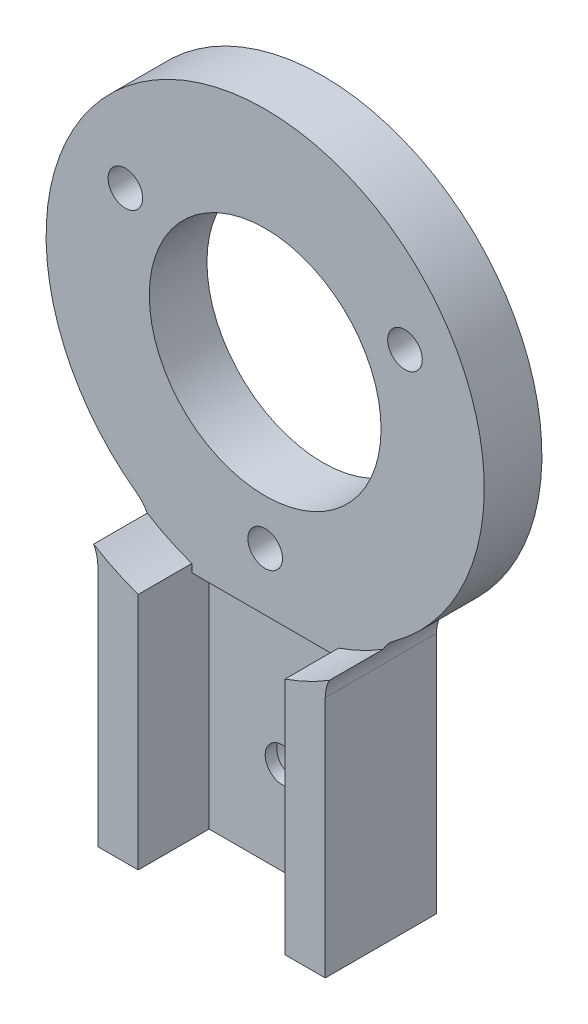
ISO-10303-21;
HEADER;
FILE_DESCRIPTION(('STEP AP214'),'2;1');
FILE_NAME('part.step','',(''),(''),'','','');
FILE_SCHEMA(('AUTOMOTIVE_DESIGN { 1 0 10303 214 1 1 1 1 }'));
ENDSEC;
DATA;
#1=APPLICATION_CONTEXT('core data for automotive mechanical design processes');
#2=APPLICATION_PROTOCOL_DEFINITION('international standard','automotive_design',2000,#1);
#3=PRODUCT_CONTEXT('',#1,'mechanical');
#4=PRODUCT('Part','Part','',(#3));
#5=PRODUCT_RELATED_PRODUCT_CATEGORY('part','',(#4));
#6=PRODUCT_DEFINITION_FORMATION('','',#4);
#7=PRODUCT_DEFINITION_CONTEXT('part definition',#1,'design');
#8=PRODUCT_DEFINITION('design','',#6,#7);
#9=PRODUCT_DEFINITION_SHAPE('','',#8);
#10=(LENGTH_UNIT() NAMED_UNIT(*) SI_UNIT(.MILLI.,.METRE.));
#11=(NAMED_UNIT(*) PLANE_ANGLE_UNIT() SI_UNIT($,.RADIAN.));
#12=(NAMED_UNIT(*) SI_UNIT($,.STERADIAN.) SOLID_ANGLE_UNIT());
#13=UNCERTAINTY_MEASURE_WITH_UNIT(LENGTH_MEASURE(1.E-05),#10,'distance_accuracy_value','');
#14=(GEOMETRIC_REPRESENTATION_CONTEXT(3) GLOBAL_UNCERTAINTY_ASSIGNED_CONTEXT((#13)) GLOBAL_UNIT_ASSIGNED_CONTEXT((#10,
#11,#12)) REPRESENTATION_CONTEXT('',''));
#15=CARTESIAN_POINT('',(0.,0.,0.));
#16=DIRECTION('',(0.,0.,1.));
#17=DIRECTION('',(1.,0.,0.));
#18=AXIS2_PLACEMENT_3D('',#15,#16,#17);
#19=CARTESIAN_POINT('',(0.,-31.,7.));
#20=DIRECTION('',(0.,0.,-1.));
#21=DIRECTION('',(-1.,0.,0.));
#22=AXIS2_PLACEMENT_3D('',#19,#20,#21);
#23=CYLINDRICAL_SURFACE('',#22,1.5);
#24=CARTESIAN_POINT('',(0.,-31.,3.5));
#25=DIRECTION('',(0.,0.,-1.));
#26=DIRECTION('',(-1.,0.,0.));
#27=AXIS2_PLACEMENT_3D('',#24,#25,#26);
#28=CIRCLE('',#27,1.5);
#29=CARTESIAN_POINT('',(-1.5,-31.,3.5));
#30=VERTEX_POINT('',#29);
#31=EDGE_CURVE('E257',#30,#30,#28,.T.);
#32=ORIENTED_EDGE('',*,*,#31,.F.);
#33=EDGE_LOOP('',(#32));
#34=FACE_BOUND('',#33,.T.);
#35=CARTESIAN_POINT('',(0.,-31.,2.5));
#36=DIRECTION('',(0.,0.,-1.));
#37=DIRECTION('',(-1.,0.,0.));
#38=AXIS2_PLACEMENT_3D('',#35,#36,#37);
#39=CIRCLE('',#38,1.5);
#40=CARTESIAN_POINT('',(-1.5,-31.,2.5));
#41=VERTEX_POINT('',#40);
#42=EDGE_CURVE('E262',#41,#41,#39,.F.);
#43=ORIENTED_EDGE('',*,*,#42,.F.);
#44=EDGE_LOOP('',(#43));
#45=FACE_BOUND('',#44,.T.);
#46=ADVANCED_FACE('F37',(#34,#45),#23,.F.);
#47=CARTESIAN_POINT('',(0.,0.,5.));
#48=DIRECTION('',(0.,0.,-1.));
#49=DIRECTION('',(-1.,0.,0.));
#50=AXIS2_PLACEMENT_3D('',#47,#48,#49);
#51=PLANE('',#50);
#52=CARTESIAN_POINT('',(0.,-14.,5.));
#53=DIRECTION('',(0.,0.,1.));
#54=DIRECTION('',(1.,0.,0.));
#55=AXIS2_PLACEMENT_3D('',#52,#53,#54);
#56=CIRCLE('',#55,1.5);
#57=CARTESIAN_POINT('',(1.5,-14.,5.));
#58=VERTEX_POINT('',#57);
#59=EDGE_CURVE('E212',#58,#58,#56,.T.);
#60=ORIENTED_EDGE('',*,*,#59,.F.);
#61=EDGE_LOOP('',(#60));
#62=FACE_BOUND('',#61,.T.);
#63=CARTESIAN_POINT('',(-12.1243556529822,6.99999999999997,5.));
#64=DIRECTION('',(0.,0.,1.));
#65=DIRECTION('',(1.,0.,0.));
#66=AXIS2_PLACEMENT_3D('',#63,#64,#65);
#67=CIRCLE('',#66,1.5);
#68=CARTESIAN_POINT('',(-10.6243556529822,6.99999999999997,5.));
#69=VERTEX_POINT('',#68);
#70=EDGE_CURVE('E209',#69,#69,#67,.T.);
#71=ORIENTED_EDGE('',*,*,#70,.F.);
#72=EDGE_LOOP('',(#71));
#73=FACE_BOUND('',#72,.T.);
#74=CARTESIAN_POINT('',(12.1243556529821,7.00000000000006,5.));
#75=DIRECTION('',(0.,0.,1.));
#76=DIRECTION('',(1.,0.,0.));
#77=AXIS2_PLACEMENT_3D('',#74,#75,#76);
#78=CIRCLE('',#77,1.5);
#79=CARTESIAN_POINT('',(13.6243556529821,7.00000000000006,5.));
#80=VERTEX_POINT('',#79);
#81=EDGE_CURVE('E206',#80,#80,#78,.T.);
#82=ORIENTED_EDGE('',*,*,#81,.F.);
#83=EDGE_LOOP('',(#82));
#84=FACE_BOUND('',#83,.T.);
#85=CARTESIAN_POINT('',(0.,0.,5.));
#86=DIRECTION('',(0.,0.,-1.));
#87=DIRECTION('',(-1.,0.,0.));
#88=AXIS2_PLACEMENT_3D('',#85,#86,#87);
#89=CIRCLE('',#88,10.05);
#90=CARTESIAN_POINT('',(-10.05,0.,5.));
#91=VERTEX_POINT('',#90);
#92=EDGE_CURVE('E172',#91,#91,#89,.T.);
#93=ORIENTED_EDGE('',*,*,#92,.T.);
#94=EDGE_LOOP('',(#93));
#95=FACE_BOUND('',#94,.T.);
#96=CARTESIAN_POINT('',(0.,0.,5.));
#97=DIRECTION('',(0.,0.,1.));
#98=DIRECTION('',(-1.,0.,0.));
#99=AXIS2_PLACEMENT_3D('',#96,#97,#98);
#100=CIRCLE('',#99,19.);
#101=CARTESIAN_POINT('',(11.1686583990981,-15.3707862376736,5.));
#102=VERTEX_POINT('',#101);
#103=CARTESIAN_POINT('',(-11.1686583990981,-15.3707862376736,5.));
#104=VERTEX_POINT('',#103);
#105=EDGE_CURVE('E239',#102,#104,#100,.T.);
#106=ORIENTED_EDGE('',*,*,#105,.T.);
#107=CARTESIAN_POINT('',(-13.035,-17.9393255168638,5.));
#108=DIRECTION('',(0.,0.,-1.));
#109=DIRECTION('',(-1.,0.,0.));
#110=AXIS2_PLACEMENT_3D('',#107,#108,#109);
#111=CIRCLE('',#110,3.175);
#112=CARTESIAN_POINT('',(-10.2282118783563,-16.4552212616984,5.));
#113=VERTEX_POINT('',#112);
#114=EDGE_CURVE('E291',#104,#113,#111,.T.);
#115=ORIENTED_EDGE('',*,*,#114,.T.);
#116=CARTESIAN_POINT('',(0.,0.,5.));
#117=DIRECTION('',(0.,0.,1.));
#118=DIRECTION('',(-1.,0.,0.));
#119=AXIS2_PLACEMENT_3D('',#116,#117,#118);
#120=CIRCLE('',#119,19.375);
#121=CARTESIAN_POINT('',(-6.36,-18.3013940725837,5.));
#122=VERTEX_POINT('',#121);
#123=EDGE_CURVE('E58',#113,#122,#120,.T.);
#124=ORIENTED_EDGE('',*,*,#123,.T.);
#125=DIRECTION('',(0.,-1.,0.));
#126=VECTOR('',#125,1.);
#127=CARTESIAN_POINT('',(-6.36,-19.,5.));
#128=LINE('',#127,#126);
#129=CARTESIAN_POINT('',(-6.36,-19.,5.));
#130=VERTEX_POINT('',#129);
#131=EDGE_CURVE('E154',#122,#130,#128,.T.);
#132=ORIENTED_EDGE('',*,*,#131,.T.);
#133=DIRECTION('',(-1.,0.,0.));
#134=VECTOR('',#133,1.);
#135=CARTESIAN_POINT('',(-6.36,-19.,5.));
#136=LINE('',#135,#134);
#137=CARTESIAN_POINT('',(6.36,-19.,5.));
#138=VERTEX_POINT('',#137);
#139=EDGE_CURVE('E225',#138,#130,#136,.T.);
#140=ORIENTED_EDGE('',*,*,#139,.F.);
#141=DIRECTION('',(0.,-1.,0.));
#142=VECTOR('',#141,1.);
#143=CARTESIAN_POINT('',(6.36,-19.,5.));
#144=LINE('',#143,#142);
#145=CARTESIAN_POINT('',(6.36,-18.3013940725837,5.));
#146=VERTEX_POINT('',#145);
#147=EDGE_CURVE('E165',#146,#138,#144,.T.);
#148=ORIENTED_EDGE('',*,*,#147,.F.);
#149=CARTESIAN_POINT('',(0.,0.,5.));
#150=DIRECTION('',(0.,0.,-1.));
#151=DIRECTION('',(1.,0.,0.));
#152=AXIS2_PLACEMENT_3D('',#149,#150,#151);
#153=CIRCLE('',#152,19.375);
#154=CARTESIAN_POINT('',(10.2282118783563,-16.4552212616984,5.));
#155=VERTEX_POINT('',#154);
#156=EDGE_CURVE('E150',#155,#146,#153,.T.);
#157=ORIENTED_EDGE('',*,*,#156,.F.);
#158=CARTESIAN_POINT('',(13.035,-17.9393255168638,5.));
#159=DIRECTION('',(0.,0.,-1.));
#160=DIRECTION('',(-1.,0.,0.));
#161=AXIS2_PLACEMENT_3D('',#158,#159,#160);
#162=CIRCLE('',#161,3.175);
#163=EDGE_CURVE('E287',#155,#102,#162,.T.);
#164=ORIENTED_EDGE('',*,*,#163,.T.);
#165=EDGE_LOOP('',(#106,#115,#124,#132,#140,#148,#157,#164));
#166=FACE_BOUND('',#165,.T.);
#167=ADVANCED_FACE('F294',(#62,#73,#84,#95,#166),#51,.F.);
#168=CARTESIAN_POINT('',(-12.1243556529822,6.99999999999997,0.));
#169=DIRECTION('',(0.,0.,1.));
#170=DIRECTION('',(1.,0.,0.));
#171=AXIS2_PLACEMENT_3D('',#168,#169,#170);
#172=CYLINDRICAL_SURFACE('',#171,1.5);
#173=ORIENTED_EDGE('',*,*,#70,.T.);
#174=EDGE_LOOP('',(#173));
#175=FACE_BOUND('',#174,.T.);
#176=CARTESIAN_POINT('',(-12.1243556529822,6.99999999999997,2.5));
#177=DIRECTION('',(0.,0.,-1.));
#178=DIRECTION('',(-1.,0.,0.));
#179=AXIS2_PLACEMENT_3D('',#176,#177,#178);
#180=CIRCLE('',#179,1.5);
#181=CARTESIAN_POINT('',(-13.6243556529822,6.99999999999997,2.5));
#182=VERTEX_POINT('',#181);
#183=EDGE_CURVE('E179',#182,#182,#180,.F.);
#184=ORIENTED_EDGE('',*,*,#183,.F.);
#185=EDGE_LOOP('',(#184));
#186=FACE_BOUND('',#185,.T.);
#187=ADVANCED_FACE('F317',(#175,#186),#172,.F.);
#188=CARTESIAN_POINT('',(12.1243556529821,7.00000000000006,0.));
#189=DIRECTION('',(0.,0.,1.));
#190=DIRECTION('',(1.,0.,0.));
#191=AXIS2_PLACEMENT_3D('',#188,#189,#190);
#192=CYLINDRICAL_SURFACE('',#191,1.5);
#193=ORIENTED_EDGE('',*,*,#81,.T.);
#194=EDGE_LOOP('',(#193));
#195=FACE_BOUND('',#194,.T.);
#196=CARTESIAN_POINT('',(12.1243556529821,7.00000000000006,2.5));
#197=DIRECTION('',(0.,0.,-1.));
#198=DIRECTION('',(-1.,0.,0.));
#199=AXIS2_PLACEMENT_3D('',#196,#197,#198);
#200=CIRCLE('',#199,1.5);
#201=CARTESIAN_POINT('',(10.6243556529821,7.00000000000006,2.5));
#202=VERTEX_POINT('',#201);
#203=EDGE_CURVE('E185',#202,#202,#200,.F.);
#204=ORIENTED_EDGE('',*,*,#203,.F.);
#205=EDGE_LOOP('',(#204));
#206=FACE_BOUND('',#205,.T.);
#207=ADVANCED_FACE('F314',(#195,#206),#192,.F.);
#208=CARTESIAN_POINT('',(0.,-14.,0.));
#209=DIRECTION('',(0.,0.,1.));
#210=DIRECTION('',(1.,0.,0.));
#211=AXIS2_PLACEMENT_3D('',#208,#209,#210);
#212=CYLINDRICAL_SURFACE('',#211,1.5);
#213=ORIENTED_EDGE('',*,*,#59,.T.);
#214=EDGE_LOOP('',(#213));
#215=FACE_BOUND('',#214,.T.);
#216=CARTESIAN_POINT('',(0.,-14.,2.5));
#217=DIRECTION('',(0.,0.,-1.));
#218=DIRECTION('',(-1.,0.,0.));
#219=AXIS2_PLACEMENT_3D('',#216,#217,#218);
#220=CIRCLE('',#219,1.5);
#221=CARTESIAN_POINT('',(-1.5,-14.,2.5));
#222=VERTEX_POINT('',#221);
#223=EDGE_CURVE('E192',#222,#222,#220,.F.);
#224=ORIENTED_EDGE('',*,*,#223,.F.);
#225=EDGE_LOOP('',(#224));
#226=FACE_BOUND('',#225,.T.);
#227=ADVANCED_FACE('F316',(#215,#226),#212,.F.);
#228=CARTESIAN_POINT('',(0.,0.,0.));
#229=DIRECTION('',(0.,0.,-1.));
#230=DIRECTION('',(-1.,0.,0.));
#231=AXIS2_PLACEMENT_3D('',#228,#229,#230);
#232=PLANE('',#231);
#233=CARTESIAN_POINT('',(0.,-31.,0.));
#234=DIRECTION('',(0.,0.,-1.));
#235=DIRECTION('',(-1.,0.,0.));
#236=AXIS2_PLACEMENT_3D('',#233,#234,#235);
#237=CIRCLE('',#236,3.);
#238=CARTESIAN_POINT('',(-3.,-31.,0.));
#239=VERTEX_POINT('',#238);
#240=EDGE_CURVE('E454',#239,#239,#237,.T.);
#241=ORIENTED_EDGE('',*,*,#240,.F.);
#242=EDGE_LOOP('',(#241));
#243=FACE_BOUND('',#242,.T.);
#244=CARTESIAN_POINT('',(0.,0.,0.));
#245=DIRECTION('',(0.,0.,-1.));
#246=DIRECTION('',(-1.,0.,0.));
#247=AXIS2_PLACEMENT_3D('',#244,#245,#246);
#248=CIRCLE('',#247,10.05);
#249=CARTESIAN_POINT('',(-10.05,0.,0.));
#250=VERTEX_POINT('',#249);
#251=EDGE_CURVE('E161',#250,#250,#248,.T.);
#252=ORIENTED_EDGE('',*,*,#251,.F.);
#253=EDGE_LOOP('',(#252));
#254=FACE_BOUND('',#253,.T.);
#255=CARTESIAN_POINT('',(-12.1243556529822,6.99999999999997,0.));
#256=DIRECTION('',(0.,0.,-1.));
#257=DIRECTION('',(-1.,0.,0.));
#258=AXIS2_PLACEMENT_3D('',#255,#256,#257);
#259=CIRCLE('',#258,3.);
#260=CARTESIAN_POINT('',(-15.1243556529822,6.99999999999997,0.));
#261=VERTEX_POINT('',#260);
#262=EDGE_CURVE('E175',#261,#261,#259,.T.);
#263=ORIENTED_EDGE('',*,*,#262,.F.);
#264=EDGE_LOOP('',(#263));
#265=FACE_BOUND('',#264,.T.);
#266=CARTESIAN_POINT('',(12.1243556529821,7.00000000000006,0.));
#267=DIRECTION('',(0.,0.,-1.));
#268=DIRECTION('',(-1.,0.,0.));
#269=AXIS2_PLACEMENT_3D('',#266,#267,#268);
#270=CIRCLE('',#269,3.);
#271=CARTESIAN_POINT('',(9.12435565298211,7.00000000000006,0.));
#272=VERTEX_POINT('',#271);
#273=EDGE_CURVE('E186',#272,#272,#270,.T.);
#274=ORIENTED_EDGE('',*,*,#273,.F.);
#275=EDGE_LOOP('',(#274));
#276=FACE_BOUND('',#275,.T.);
#277=CARTESIAN_POINT('',(0.,-14.,0.));
#278=DIRECTION('',(0.,0.,-1.));
#279=DIRECTION('',(-1.,0.,0.));
#280=AXIS2_PLACEMENT_3D('',#277,#278,#279);
#281=CIRCLE('',#280,3.);
#282=CARTESIAN_POINT('',(-3.,-14.,0.));
#283=VERTEX_POINT('',#282);
#284=EDGE_CURVE('E193',#283,#283,#281,.T.);
#285=ORIENTED_EDGE('',*,*,#284,.F.);
#286=EDGE_LOOP('',(#285));
#287=FACE_BOUND('',#286,.T.);
#288=DIRECTION('',(0.,-1.,0.));
#289=VECTOR('',#288,1.);
#290=CARTESIAN_POINT('',(-9.86,-39.,0.));
#291=LINE('',#290,#289);
#292=CARTESIAN_POINT('',(-9.86,-17.9393255168638,0.));
#293=VERTEX_POINT('',#292);
#294=CARTESIAN_POINT('',(-9.86,-39.,0.));
#295=VERTEX_POINT('',#294);
#296=EDGE_CURVE('E236',#293,#295,#291,.T.);
#297=ORIENTED_EDGE('',*,*,#296,.F.);
#298=CARTESIAN_POINT('',(-13.035,-17.9393255168638,0.));
#299=DIRECTION('',(0.,0.,-1.));
#300=DIRECTION('',(-1.,0.,0.));
#301=AXIS2_PLACEMENT_3D('',#298,#299,#300);
#302=CIRCLE('',#301,3.175);
#303=CARTESIAN_POINT('',(-11.1686583990981,-15.3707862376736,0.));
#304=VERTEX_POINT('',#303);
#305=EDGE_CURVE('E289',#293,#304,#302,.F.);
#306=ORIENTED_EDGE('',*,*,#305,.T.);
#307=CARTESIAN_POINT('',(0.,0.,0.));
#308=DIRECTION('',(0.,0.,1.));
#309=DIRECTION('',(-1.,0.,0.));
#310=AXIS2_PLACEMENT_3D('',#307,#308,#309);
#311=CIRCLE('',#310,19.);
#312=CARTESIAN_POINT('',(11.1686583990981,-15.3707862376736,0.));
#313=VERTEX_POINT('',#312);
#314=EDGE_CURVE('E243',#313,#304,#311,.T.);
#315=ORIENTED_EDGE('',*,*,#314,.F.);
#316=CARTESIAN_POINT('',(13.035,-17.9393255168638,0.));
#317=DIRECTION('',(0.,0.,-1.));
#318=DIRECTION('',(-1.,0.,0.));
#319=AXIS2_PLACEMENT_3D('',#316,#317,#318);
#320=CIRCLE('',#319,3.175);
#321=CARTESIAN_POINT('',(9.86,-17.9393255168638,0.));
#322=VERTEX_POINT('',#321);
#323=EDGE_CURVE('E279',#313,#322,#320,.F.);
#324=ORIENTED_EDGE('',*,*,#323,.T.);
#325=DIRECTION('',(0.,1.,0.));
#326=VECTOR('',#325,1.);
#327=CARTESIAN_POINT('',(9.86,-39.,0.));
#328=LINE('',#327,#326);
#329=CARTESIAN_POINT('',(9.86,-39.,0.));
#330=VERTEX_POINT('',#329);
#331=EDGE_CURVE('E247',#330,#322,#328,.T.);
#332=ORIENTED_EDGE('',*,*,#331,.F.);
#333=DIRECTION('',(1.,0.,0.));
#334=VECTOR('',#333,1.);
#335=CARTESIAN_POINT('',(9.86,-39.,0.));
#336=LINE('',#335,#334);
#337=EDGE_CURVE('E244',#295,#330,#336,.T.);
#338=ORIENTED_EDGE('',*,*,#337,.F.);
#339=EDGE_LOOP('',(#297,#306,#315,#324,#332,#338));
#340=FACE_BOUND('',#339,.T.);
#341=ADVANCED_FACE('F324',(#243,#254,#265,#276,#287,#340),#232,.T.);
#342=CARTESIAN_POINT('',(-9.86,-39.,5.));
#343=DIRECTION('',(1.,0.,0.));
#344=DIRECTION('',(0.,0.,-1.));
#345=AXIS2_PLACEMENT_3D('',#342,#343,#344);
#346=PLANE('',#345);
#347=DIRECTION('',(0.,1.,0.));
#348=VECTOR('',#347,1.);
#349=CARTESIAN_POINT('',(-9.86,-39.,9.65));
#350=LINE('',#349,#348);
#351=CARTESIAN_POINT('',(-9.86,-39.,9.65));
#352=VERTEX_POINT('',#351);
#353=CARTESIAN_POINT('',(-9.86,-17.9393255168638,9.65));
#354=VERTEX_POINT('',#353);
#355=EDGE_CURVE('E203',#352,#354,#350,.T.);
#356=ORIENTED_EDGE('',*,*,#355,.T.);
#357=DIRECTION('',(0.,0.,1.));
#358=VECTOR('',#357,1.);
#359=CARTESIAN_POINT('',(-9.86,-17.9393255168638,0.));
#360=LINE('',#359,#358);
#361=EDGE_CURVE('E276',#354,#293,#360,.F.);
#362=ORIENTED_EDGE('',*,*,#361,.T.);
#363=ORIENTED_EDGE('',*,*,#296,.T.);
#364=DIRECTION('',(0.,0.,-1.));
#365=VECTOR('',#364,1.);
#366=CARTESIAN_POINT('',(-9.86,-39.,5.));
#367=LINE('',#366,#365);
#368=EDGE_CURVE('E271',#352,#295,#367,.T.);
#369=ORIENTED_EDGE('',*,*,#368,.F.);
#370=EDGE_LOOP('',(#356,#362,#363,#369));
#371=FACE_BOUND('',#370,.T.);
#372=ADVANCED_FACE('F300',(#371),#346,.F.);
#373=CARTESIAN_POINT('',(9.86,-39.,5.));
#374=DIRECTION('',(0.,1.,0.));
#375=DIRECTION('',(0.,0.,1.));
#376=AXIS2_PLACEMENT_3D('',#373,#374,#375);
#377=PLANE('',#376);
#378=DIRECTION('',(1.,0.,0.));
#379=VECTOR('',#378,1.);
#380=CARTESIAN_POINT('',(6.36,-39.,3.5));
#381=LINE('',#380,#379);
#382=CARTESIAN_POINT('',(-6.36,-39.,3.5));
#383=VERTEX_POINT('',#382);
#384=CARTESIAN_POINT('',(6.36,-39.,3.5));
#385=VERTEX_POINT('',#384);
#386=EDGE_CURVE('E230',#383,#385,#381,.T.);
#387=ORIENTED_EDGE('',*,*,#386,.F.);
#388=DIRECTION('',(0.,0.,-1.));
#389=VECTOR('',#388,1.);
#390=CARTESIAN_POINT('',(-6.36,-39.,3.5));
#391=LINE('',#390,#389);
#392=CARTESIAN_POINT('',(-6.36,-39.,9.65));
#393=VERTEX_POINT('',#392);
#394=EDGE_CURVE('E215',#393,#383,#391,.T.);
#395=ORIENTED_EDGE('',*,*,#394,.F.);
#396=DIRECTION('',(-1.,0.,0.));
#397=VECTOR('',#396,1.);
#398=CARTESIAN_POINT('',(-9.86,-39.,9.65));
#399=LINE('',#398,#397);
#400=EDGE_CURVE('E140',#393,#352,#399,.T.);
#401=ORIENTED_EDGE('',*,*,#400,.T.);
#402=ORIENTED_EDGE('',*,*,#368,.T.);
#403=ORIENTED_EDGE('',*,*,#337,.T.);
#404=DIRECTION('',(0.,0.,-1.));
#405=VECTOR('',#404,1.);
#406=CARTESIAN_POINT('',(9.86,-39.,5.));
#407=LINE('',#406,#405);
#408=CARTESIAN_POINT('',(9.86,-39.,9.65));
#409=VERTEX_POINT('',#408);
#410=EDGE_CURVE('E242',#409,#330,#407,.T.);
#411=ORIENTED_EDGE('',*,*,#410,.F.);
#412=DIRECTION('',(-1.,0.,0.));
#413=VECTOR('',#412,1.);
#414=CARTESIAN_POINT('',(6.36,-39.,9.65));
#415=LINE('',#414,#413);
#416=CARTESIAN_POINT('',(6.36,-39.,9.65));
#417=VERTEX_POINT('',#416);
#418=EDGE_CURVE('E198',#409,#417,#415,.T.);
#419=ORIENTED_EDGE('',*,*,#418,.T.);
#420=DIRECTION('',(0.,0.,1.));
#421=VECTOR('',#420,1.);
#422=CARTESIAN_POINT('',(6.36,-39.,5.));
#423=LINE('',#422,#421);
#424=EDGE_CURVE('E220',#385,#417,#423,.T.);
#425=ORIENTED_EDGE('',*,*,#424,.F.);
#426=EDGE_LOOP('',(#387,#395,#401,#402,#403,#411,#419,#425));
#427=FACE_BOUND('',#426,.T.);
#428=ADVANCED_FACE('F411',(#427),#377,.F.);
#429=CARTESIAN_POINT('',(9.86,-39.,5.));
#430=DIRECTION('',(-1.,0.,0.));
#431=DIRECTION('',(0.,0.,1.));
#432=AXIS2_PLACEMENT_3D('',#429,#430,#431);
#433=PLANE('',#432);
#434=ORIENTED_EDGE('',*,*,#331,.T.);
#435=DIRECTION('',(0.,0.,1.));
#436=VECTOR('',#435,1.);
#437=CARTESIAN_POINT('',(9.86,-17.9393255168638,5.));
#438=LINE('',#437,#436);
#439=CARTESIAN_POINT('',(9.86,-17.9393255168638,9.65));
#440=VERTEX_POINT('',#439);
#441=EDGE_CURVE('E274',#322,#440,#438,.T.);
#442=ORIENTED_EDGE('',*,*,#441,.T.);
#443=DIRECTION('',(0.,-1.,0.));
#444=VECTOR('',#443,1.);
#445=CARTESIAN_POINT('',(9.86,-39.,9.65));
#446=LINE('',#445,#444);
#447=EDGE_CURVE('E196',#440,#409,#446,.T.);
#448=ORIENTED_EDGE('',*,*,#447,.T.);
#449=ORIENTED_EDGE('',*,*,#410,.T.);
#450=EDGE_LOOP('',(#434,#442,#448,#449));
#451=FACE_BOUND('',#450,.T.);
#452=ADVANCED_FACE('F407',(#451),#433,.F.);
#453=CARTESIAN_POINT('',(0.,0.,5.));
#454=DIRECTION('',(0.,0.,-1.));
#455=DIRECTION('',(-1.,0.,0.));
#456=AXIS2_PLACEMENT_3D('',#453,#454,#455);
#457=CYLINDRICAL_SURFACE('',#456,19.);
#458=ORIENTED_EDGE('',*,*,#105,.F.);
#459=DIRECTION('',(0.,0.,-1.));
#460=VECTOR('',#459,1.);
#461=CARTESIAN_POINT('',(11.1686583990981,-15.3707862376736,5.));
#462=LINE('',#461,#460);
#463=EDGE_CURVE('E270',#102,#313,#462,.T.);
#464=ORIENTED_EDGE('',*,*,#463,.T.);
#465=ORIENTED_EDGE('',*,*,#314,.T.);
#466=DIRECTION('',(0.,0.,-1.));
#467=VECTOR('',#466,1.);
#468=CARTESIAN_POINT('',(-11.1686583990981,-15.3707862376736,5.));
#469=LINE('',#468,#467);
#470=EDGE_CURVE('E268',#304,#104,#469,.F.);
#471=ORIENTED_EDGE('',*,*,#470,.T.);
#472=EDGE_LOOP('',(#458,#464,#465,#471));
#473=FACE_BOUND('',#472,.T.);
#474=ADVANCED_FACE('F400',(#473),#457,.T.);
#475=CARTESIAN_POINT('',(-6.36,-19.,3.5));
#476=DIRECTION('',(-1.,0.,0.));
#477=DIRECTION('',(0.,0.,1.));
#478=AXIS2_PLACEMENT_3D('',#475,#476,#477);
#479=PLANE('',#478);
#480=ORIENTED_EDGE('',*,*,#394,.T.);
#481=DIRECTION('',(0.,-1.,0.));
#482=VECTOR('',#481,1.);
#483=CARTESIAN_POINT('',(-6.36,-19.,3.5));
#484=LINE('',#483,#482);
#485=CARTESIAN_POINT('',(-6.36,-19.,3.5));
#486=VERTEX_POINT('',#485);
#487=EDGE_CURVE('E228',#486,#383,#484,.T.);
#488=ORIENTED_EDGE('',*,*,#487,.F.);
#489=DIRECTION('',(0.,0.,-1.));
#490=VECTOR('',#489,1.);
#491=CARTESIAN_POINT('',(-6.36,-19.,3.5));
#492=LINE('',#491,#490);
#493=EDGE_CURVE('E216',#130,#486,#492,.T.);
#494=ORIENTED_EDGE('',*,*,#493,.F.);
#495=ORIENTED_EDGE('',*,*,#131,.F.);
#496=DIRECTION('',(0.,0.,-1.));
#497=VECTOR('',#496,1.);
#498=CARTESIAN_POINT('',(-6.36,-18.3013940725837,13.8499462359926));
#499=LINE('',#498,#497);
#500=CARTESIAN_POINT('',(-6.36,-18.3013940725837,9.65));
#501=VERTEX_POINT('',#500);
#502=EDGE_CURVE('E146',#501,#122,#499,.T.);
#503=ORIENTED_EDGE('',*,*,#502,.F.);
#504=DIRECTION('',(0.,-1.,0.));
#505=VECTOR('',#504,1.);
#506=CARTESIAN_POINT('',(-6.36,-39.,9.65));
#507=LINE('',#506,#505);
#508=EDGE_CURVE('E136',#501,#393,#507,.T.);
#509=ORIENTED_EDGE('',*,*,#508,.T.);
#510=EDGE_LOOP('',(#480,#488,#494,#495,#503,#509));
#511=FACE_BOUND('',#510,.T.);
#512=ADVANCED_FACE('F152',(#511),#479,.F.);
#513=CARTESIAN_POINT('',(6.36,-19.,5.));
#514=DIRECTION('',(1.,0.,0.));
#515=DIRECTION('',(0.,0.,-1.));
#516=AXIS2_PLACEMENT_3D('',#513,#514,#515);
#517=PLANE('',#516);
#518=ORIENTED_EDGE('',*,*,#424,.T.);
#519=DIRECTION('',(0.,1.,0.));
#520=VECTOR('',#519,1.);
#521=CARTESIAN_POINT('',(6.36,-39.,9.65));
#522=LINE('',#521,#520);
#523=CARTESIAN_POINT('',(6.36,-18.3013940725837,9.65));
#524=VERTEX_POINT('',#523);
#525=EDGE_CURVE('E143',#417,#524,#522,.T.);
#526=ORIENTED_EDGE('',*,*,#525,.T.);
#527=DIRECTION('',(0.,0.,-1.));
#528=VECTOR('',#527,1.);
#529=CARTESIAN_POINT('',(6.36,-18.3013940725837,13.8499462359926));
#530=LINE('',#529,#528);
#531=EDGE_CURVE('E162',#524,#146,#530,.T.);
#532=ORIENTED_EDGE('',*,*,#531,.T.);
#533=ORIENTED_EDGE('',*,*,#147,.T.);
#534=DIRECTION('',(0.,0.,1.));
#535=VECTOR('',#534,1.);
#536=CARTESIAN_POINT('',(6.36,-19.,5.));
#537=LINE('',#536,#535);
#538=CARTESIAN_POINT('',(6.36,-19.,3.5));
#539=VERTEX_POINT('',#538);
#540=EDGE_CURVE('E223',#539,#138,#537,.T.);
#541=ORIENTED_EDGE('',*,*,#540,.F.);
#542=DIRECTION('',(0.,-1.,0.));
#543=VECTOR('',#542,1.);
#544=CARTESIAN_POINT('',(6.36,-19.,3.5));
#545=LINE('',#544,#543);
#546=EDGE_CURVE('E234',#539,#385,#545,.T.);
#547=ORIENTED_EDGE('',*,*,#546,.T.);
#548=EDGE_LOOP('',(#518,#526,#532,#533,#541,#547));
#549=FACE_BOUND('',#548,.T.);
#550=ADVANCED_FACE('F392',(#549),#517,.F.);
#551=CARTESIAN_POINT('',(6.36,-19.,3.5));
#552=DIRECTION('',(0.,0.,-1.));
#553=DIRECTION('',(-1.,0.,0.));
#554=AXIS2_PLACEMENT_3D('',#551,#552,#553);
#555=PLANE('',#554);
#556=ORIENTED_EDGE('',*,*,#31,.T.);
#557=EDGE_LOOP('',(#556));
#558=FACE_BOUND('',#557,.T.);
#559=ORIENTED_EDGE('',*,*,#386,.T.);
#560=ORIENTED_EDGE('',*,*,#546,.F.);
#561=DIRECTION('',(1.,0.,0.));
#562=VECTOR('',#561,1.);
#563=CARTESIAN_POINT('',(6.36,-19.,3.5));
#564=LINE('',#563,#562);
#565=EDGE_CURVE('E219',#486,#539,#564,.T.);
#566=ORIENTED_EDGE('',*,*,#565,.F.);
#567=ORIENTED_EDGE('',*,*,#487,.T.);
#568=EDGE_LOOP('',(#559,#560,#566,#567));
#569=FACE_BOUND('',#568,.T.);
#570=ADVANCED_FACE('F386',(#558,#569),#555,.F.);
#571=CARTESIAN_POINT('',(0.,-19.,0.));
#572=DIRECTION('',(0.,1.,0.));
#573=DIRECTION('',(0.,0.,1.));
#574=AXIS2_PLACEMENT_3D('',#571,#572,#573);
#575=PLANE('',#574);
#576=ORIENTED_EDGE('',*,*,#493,.T.);
#577=ORIENTED_EDGE('',*,*,#565,.T.);
#578=ORIENTED_EDGE('',*,*,#540,.T.);
#579=ORIENTED_EDGE('',*,*,#139,.T.);
#580=EDGE_LOOP('',(#576,#577,#578,#579));
#581=FACE_BOUND('',#580,.T.);
#582=ADVANCED_FACE('F382',(#581),#575,.F.);
#583=CARTESIAN_POINT('',(0.,0.,9.65));
#584=DIRECTION('',(0.,0.,-1.));
#585=DIRECTION('',(-1.,0.,0.));
#586=AXIS2_PLACEMENT_3D('',#583,#584,#585);
#587=PLANE('',#586);
#588=ORIENTED_EDGE('',*,*,#400,.F.);
#589=ORIENTED_EDGE('',*,*,#508,.F.);
#590=CARTESIAN_POINT('',(0.,0.,9.65));
#591=DIRECTION('',(0.,0.,-1.));
#592=DIRECTION('',(-1.,0.,0.));
#593=AXIS2_PLACEMENT_3D('',#590,#591,#592);
#594=CIRCLE('',#593,19.375);
#595=CARTESIAN_POINT('',(-10.2282118783563,-16.4552212616984,9.65));
#596=VERTEX_POINT('',#595);
#597=EDGE_CURVE('E51',#501,#596,#594,.T.);
#598=ORIENTED_EDGE('',*,*,#597,.T.);
#599=CARTESIAN_POINT('',(-13.035,-17.9393255168638,9.65));
#600=DIRECTION('',(0.,0.,-1.));
#601=DIRECTION('',(-1.,0.,0.));
#602=AXIS2_PLACEMENT_3D('',#599,#600,#601);
#603=CIRCLE('',#602,3.175);
#604=EDGE_CURVE('E13',#596,#354,#603,.T.);
#605=ORIENTED_EDGE('',*,*,#604,.T.);
#606=ORIENTED_EDGE('',*,*,#355,.F.);
#607=EDGE_LOOP('',(#588,#589,#598,#605,#606));
#608=FACE_BOUND('',#607,.T.);
#609=ADVANCED_FACE('F137',(#608),#587,.F.);
#610=CARTESIAN_POINT('',(0.,0.,9.65));
#611=DIRECTION('',(0.,0.,-1.));
#612=DIRECTION('',(-1.,0.,0.));
#613=AXIS2_PLACEMENT_3D('',#610,#611,#612);
#614=PLANE('',#613);
#615=ORIENTED_EDGE('',*,*,#418,.F.);
#616=ORIENTED_EDGE('',*,*,#447,.F.);
#617=CARTESIAN_POINT('',(13.035,-17.9393255168638,9.65));
#618=DIRECTION('',(0.,0.,-1.));
#619=DIRECTION('',(-1.,0.,0.));
#620=AXIS2_PLACEMENT_3D('',#617,#618,#619);
#621=CIRCLE('',#620,3.175);
#622=CARTESIAN_POINT('',(10.2282118783563,-16.4552212616984,9.65));
#623=VERTEX_POINT('',#622);
#624=EDGE_CURVE('E281',#440,#623,#621,.T.);
#625=ORIENTED_EDGE('',*,*,#624,.T.);
#626=CARTESIAN_POINT('',(0.,0.,9.65));
#627=DIRECTION('',(0.,0.,-1.));
#628=DIRECTION('',(-1.,0.,0.));
#629=AXIS2_PLACEMENT_3D('',#626,#627,#628);
#630=CIRCLE('',#629,19.375);
#631=EDGE_CURVE('E159',#524,#623,#630,.F.);
#632=ORIENTED_EDGE('',*,*,#631,.F.);
#633=ORIENTED_EDGE('',*,*,#525,.F.);
#634=EDGE_LOOP('',(#615,#616,#625,#632,#633));
#635=FACE_BOUND('',#634,.T.);
#636=ADVANCED_FACE('F374',(#635),#614,.F.);
#637=CARTESIAN_POINT('',(0.,-14.,2.5));
#638=DIRECTION('',(0.,0.,-1.));
#639=DIRECTION('',(-1.,0.,0.));
#640=AXIS2_PLACEMENT_3D('',#637,#638,#639);
#641=PLANE('',#640);
#642=CARTESIAN_POINT('',(0.,-14.,2.5));
#643=DIRECTION('',(0.,0.,-1.));
#644=DIRECTION('',(-1.,0.,0.));
#645=AXIS2_PLACEMENT_3D('',#642,#643,#644);
#646=CIRCLE('',#645,3.);
#647=CARTESIAN_POINT('',(-3.,-14.,2.5));
#648=VERTEX_POINT('',#647);
#649=EDGE_CURVE('E189',#648,#648,#646,.T.);
#650=ORIENTED_EDGE('',*,*,#649,.T.);
#651=EDGE_LOOP('',(#650));
#652=FACE_BOUND('',#651,.T.);
#653=ORIENTED_EDGE('',*,*,#223,.T.);
#654=EDGE_LOOP('',(#653));
#655=FACE_BOUND('',#654,.T.);
#656=ADVANCED_FACE('F371',(#652,#655),#641,.T.);
#657=CARTESIAN_POINT('',(0.,-14.,2.5));
#658=DIRECTION('',(0.,0.,-1.));
#659=DIRECTION('',(-1.,0.,0.));
#660=AXIS2_PLACEMENT_3D('',#657,#658,#659);
#661=CYLINDRICAL_SURFACE('',#660,3.);
#662=ORIENTED_EDGE('',*,*,#649,.F.);
#663=EDGE_LOOP('',(#662));
#664=FACE_BOUND('',#663,.T.);
#665=ORIENTED_EDGE('',*,*,#284,.T.);
#666=EDGE_LOOP('',(#665));
#667=FACE_BOUND('',#666,.T.);
#668=ADVANCED_FACE('F366',(#664,#667),#661,.F.);
#669=CARTESIAN_POINT('',(12.1243556529821,7.00000000000006,2.5));
#670=DIRECTION('',(0.,0.,-1.));
#671=DIRECTION('',(-1.,0.,0.));
#672=AXIS2_PLACEMENT_3D('',#669,#670,#671);
#673=PLANE('',#672);
#674=CARTESIAN_POINT('',(12.1243556529821,7.00000000000006,2.5));
#675=DIRECTION('',(0.,0.,-1.));
#676=DIRECTION('',(-1.,0.,0.));
#677=AXIS2_PLACEMENT_3D('',#674,#675,#676);
#678=CIRCLE('',#677,3.);
#679=CARTESIAN_POINT('',(9.12435565298211,7.00000000000006,2.5));
#680=VERTEX_POINT('',#679);
#681=EDGE_CURVE('E182',#680,#680,#678,.T.);
#682=ORIENTED_EDGE('',*,*,#681,.T.);
#683=EDGE_LOOP('',(#682));
#684=FACE_BOUND('',#683,.T.);
#685=ORIENTED_EDGE('',*,*,#203,.T.);
#686=EDGE_LOOP('',(#685));
#687=FACE_BOUND('',#686,.T.);
#688=ADVANCED_FACE('F312',(#684,#687),#673,.T.);
#689=CARTESIAN_POINT('',(12.1243556529821,7.00000000000006,2.5));
#690=DIRECTION('',(0.,0.,-1.));
#691=DIRECTION('',(-1.,0.,0.));
#692=AXIS2_PLACEMENT_3D('',#689,#690,#691);
#693=CYLINDRICAL_SURFACE('',#692,3.);
#694=ORIENTED_EDGE('',*,*,#681,.F.);
#695=EDGE_LOOP('',(#694));
#696=FACE_BOUND('',#695,.T.);
#697=ORIENTED_EDGE('',*,*,#273,.T.);
#698=EDGE_LOOP('',(#697));
#699=FACE_BOUND('',#698,.T.);
#700=ADVANCED_FACE('F359',(#696,#699),#693,.F.);
#701=CARTESIAN_POINT('',(-12.1243556529822,6.99999999999997,2.5));
#702=DIRECTION('',(0.,0.,-1.));
#703=DIRECTION('',(-1.,0.,0.));
#704=AXIS2_PLACEMENT_3D('',#701,#702,#703);
#705=PLANE('',#704);
#706=CARTESIAN_POINT('',(-12.1243556529822,6.99999999999997,2.5));
#707=DIRECTION('',(0.,0.,-1.));
#708=DIRECTION('',(-1.,0.,0.));
#709=AXIS2_PLACEMENT_3D('',#706,#707,#708);
#710=CIRCLE('',#709,3.);
#711=CARTESIAN_POINT('',(-15.1243556529822,6.99999999999997,2.5));
#712=VERTEX_POINT('',#711);
#713=EDGE_CURVE('E176',#712,#712,#710,.T.);
#714=ORIENTED_EDGE('',*,*,#713,.T.);
#715=EDGE_LOOP('',(#714));
#716=FACE_BOUND('',#715,.T.);
#717=ORIENTED_EDGE('',*,*,#183,.T.);
#718=EDGE_LOOP('',(#717));
#719=FACE_BOUND('',#718,.T.);
#720=ADVANCED_FACE('F356',(#716,#719),#705,.T.);
#721=CARTESIAN_POINT('',(-12.1243556529822,6.99999999999997,2.5));
#722=DIRECTION('',(0.,0.,-1.));
#723=DIRECTION('',(-1.,0.,0.));
#724=AXIS2_PLACEMENT_3D('',#721,#722,#723);
#725=CYLINDRICAL_SURFACE('',#724,3.);
#726=ORIENTED_EDGE('',*,*,#713,.F.);
#727=EDGE_LOOP('',(#726));
#728=FACE_BOUND('',#727,.T.);
#729=ORIENTED_EDGE('',*,*,#262,.T.);
#730=EDGE_LOOP('',(#729));
#731=FACE_BOUND('',#730,.T.);
#732=ADVANCED_FACE('F354',(#728,#731),#725,.F.);
#733=CARTESIAN_POINT('',(0.,0.,9.650025));
#734=DIRECTION('',(0.,0.,-1.));
#735=DIRECTION('',(-1.,0.,0.));
#736=AXIS2_PLACEMENT_3D('',#733,#734,#735);
#737=CYLINDRICAL_SURFACE('',#736,10.05);
#738=ORIENTED_EDGE('',*,*,#251,.T.);
#739=EDGE_LOOP('',(#738));
#740=FACE_BOUND('',#739,.T.);
#741=ORIENTED_EDGE('',*,*,#92,.F.);
#742=EDGE_LOOP('',(#741));
#743=FACE_BOUND('',#742,.T.);
#744=ADVANCED_FACE('F350',(#740,#743),#737,.F.);
#745=CARTESIAN_POINT('',(0.,0.,13.8499462359926));
#746=DIRECTION('',(0.,0.,-1.));
#747=DIRECTION('',(-1.,0.,0.));
#748=AXIS2_PLACEMENT_3D('',#745,#746,#747);
#749=CYLINDRICAL_SURFACE('',#748,19.375);
#750=ORIENTED_EDGE('',*,*,#531,.F.);
#751=ORIENTED_EDGE('',*,*,#631,.T.);
#752=DIRECTION('',(0.,0.,-1.));
#753=VECTOR('',#752,1.);
#754=CARTESIAN_POINT('',(10.2282118783563,-16.4552212616984,9.65));
#755=LINE('',#754,#753);
#756=EDGE_CURVE('E284',#623,#155,#755,.T.);
#757=ORIENTED_EDGE('',*,*,#756,.T.);
#758=ORIENTED_EDGE('',*,*,#156,.T.);
#759=EDGE_LOOP('',(#750,#751,#757,#758));
#760=FACE_BOUND('',#759,.T.);
#761=ADVANCED_FACE('F347',(#760),#749,.F.);
#762=CARTESIAN_POINT('',(0.,0.,13.8499462359926));
#763=DIRECTION('',(0.,0.,-1.));
#764=DIRECTION('',(-1.,0.,0.));
#765=AXIS2_PLACEMENT_3D('',#762,#763,#764);
#766=CYLINDRICAL_SURFACE('',#765,19.375);
#767=ORIENTED_EDGE('',*,*,#597,.F.);
#768=ORIENTED_EDGE('',*,*,#502,.T.);
#769=ORIENTED_EDGE('',*,*,#123,.F.);
#770=DIRECTION('',(0.,0.,-1.));
#771=VECTOR('',#770,1.);
#772=CARTESIAN_POINT('',(-10.2282118783563,-16.4552212616984,5.));
#773=LINE('',#772,#771);
#774=EDGE_CURVE('E45',#113,#596,#773,.F.);
#775=ORIENTED_EDGE('',*,*,#774,.T.);
#776=EDGE_LOOP('',(#767,#768,#769,#775));
#777=FACE_BOUND('',#776,.T.);
#778=ADVANCED_FACE('F145',(#777),#766,.F.);
#779=CARTESIAN_POINT('',(0.,-14.,2.5));
#780=DIRECTION('',(0.,0.,-1.));
#781=DIRECTION('',(-1.,0.,0.));
#782=AXIS2_PLACEMENT_3D('',#779,#780,#781);
#783=PLANE('',#782);
#784=CARTESIAN_POINT('',(0.,-31.,2.5));
#785=DIRECTION('',(0.,0.,-1.));
#786=DIRECTION('',(-1.,0.,0.));
#787=AXIS2_PLACEMENT_3D('',#784,#785,#786);
#788=CIRCLE('',#787,3.);
#789=CARTESIAN_POINT('',(-3.,-31.,2.5));
#790=VERTEX_POINT('',#789);
#791=EDGE_CURVE('E267',#790,#790,#788,.F.);
#792=ORIENTED_EDGE('',*,*,#791,.F.);
#793=EDGE_LOOP('',(#792));
#794=FACE_BOUND('',#793,.T.);
#795=ORIENTED_EDGE('',*,*,#42,.T.);
#796=EDGE_LOOP('',(#795));
#797=FACE_BOUND('',#796,.T.);
#798=ADVANCED_FACE('F346',(#794,#797),#783,.T.);
#799=CARTESIAN_POINT('',(0.,-31.,10.9852813742386));
#800=DIRECTION('',(0.,0.,-1.));
#801=DIRECTION('',(-1.,0.,0.));
#802=AXIS2_PLACEMENT_3D('',#799,#800,#801);
#803=CYLINDRICAL_SURFACE('',#802,3.);
#804=ORIENTED_EDGE('',*,*,#791,.T.);
#805=EDGE_LOOP('',(#804));
#806=FACE_BOUND('',#805,.T.);
#807=ORIENTED_EDGE('',*,*,#240,.T.);
#808=EDGE_LOOP('',(#807));
#809=FACE_BOUND('',#808,.T.);
#810=ADVANCED_FACE('F342',(#806,#809),#803,.F.);
#811=CARTESIAN_POINT('',(13.035,-17.9393255168638,5.));
#812=DIRECTION('',(0.,0.,-1.));
#813=DIRECTION('',(-1.,0.,0.));
#814=AXIS2_PLACEMENT_3D('',#811,#812,#813);
#815=CYLINDRICAL_SURFACE('',#814,3.175);
#816=ORIENTED_EDGE('',*,*,#624,.F.);
#817=ORIENTED_EDGE('',*,*,#441,.F.);
#818=ORIENTED_EDGE('',*,*,#323,.F.);
#819=ORIENTED_EDGE('',*,*,#463,.F.);
#820=ORIENTED_EDGE('',*,*,#163,.F.);
#821=ORIENTED_EDGE('',*,*,#756,.F.);
#822=EDGE_LOOP('',(#816,#817,#818,#819,#820,#821));
#823=FACE_BOUND('',#822,.T.);
#824=ADVANCED_FACE('F416',(#823),#815,.F.);
#825=CARTESIAN_POINT('',(-13.035,-17.9393255168638,5.));
#826=DIRECTION('',(0.,0.,-1.));
#827=DIRECTION('',(-1.,0.,0.));
#828=AXIS2_PLACEMENT_3D('',#825,#826,#827);
#829=CYLINDRICAL_SURFACE('',#828,3.175);
#830=ORIENTED_EDGE('',*,*,#114,.F.);
#831=ORIENTED_EDGE('',*,*,#470,.F.);
#832=ORIENTED_EDGE('',*,*,#305,.F.);
#833=ORIENTED_EDGE('',*,*,#361,.F.);
#834=ORIENTED_EDGE('',*,*,#604,.F.);
#835=ORIENTED_EDGE('',*,*,#774,.F.);
#836=EDGE_LOOP('',(#830,#831,#832,#833,#834,#835));
#837=FACE_BOUND('',#836,.T.);
#838=ADVANCED_FACE('F39',(#837),#829,.F.);
#839=CLOSED_SHELL('',(#46,#167,#187,#207,#227,#341,#372,#428,#452,#474,#512,#550,#570,#582,#609,
#636,#656,#668,#688,#700,#720,#732,#744,#761,#778,#798,#810,#824,#838));
#840=MANIFOLD_SOLID_BREP('B2',#839);
#841=ADVANCED_BREP_SHAPE_REPRESENTATION('',(#18,#840),#14);
#842=SHAPE_DEFINITION_REPRESENTATION(#9,#841);
ENDSEC;
END-ISO-10303-21;
